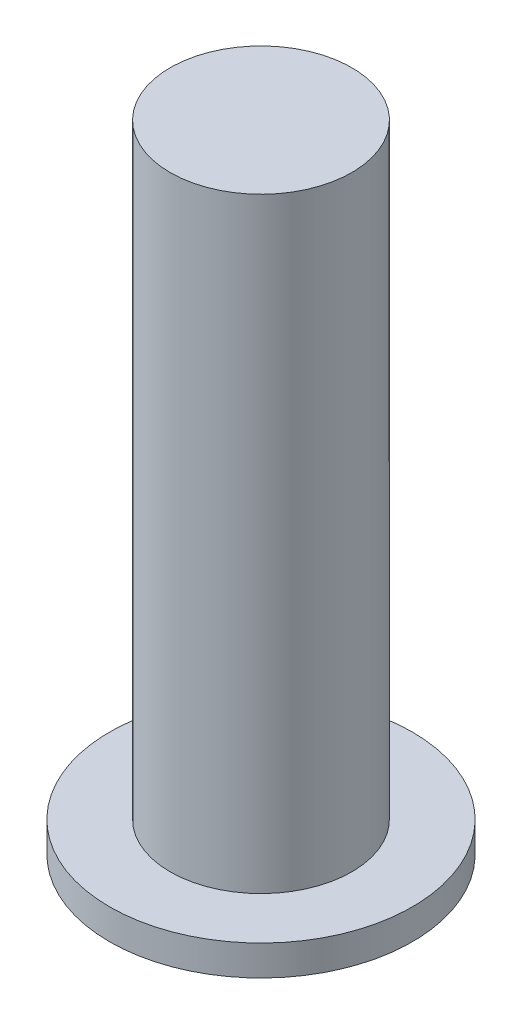
ISO-10303-21;
HEADER;
FILE_DESCRIPTION(('STEP AP214'),'2;1');
FILE_NAME('part.step','',(''),(''),'','','');
FILE_SCHEMA(('AUTOMOTIVE_DESIGN { 1 0 10303 214 1 1 1 1 }'));
ENDSEC;
DATA;
#1=APPLICATION_CONTEXT('core data for automotive mechanical design processes');
#2=APPLICATION_PROTOCOL_DEFINITION('international standard','automotive_design',2000,#1);
#3=PRODUCT_CONTEXT('',#1,'mechanical');
#4=PRODUCT('Part','Part','',(#3));
#5=PRODUCT_RELATED_PRODUCT_CATEGORY('part','',(#4));
#6=PRODUCT_DEFINITION_FORMATION('','',#4);
#7=PRODUCT_DEFINITION_CONTEXT('part definition',#1,'design');
#8=PRODUCT_DEFINITION('design','',#6,#7);
#9=PRODUCT_DEFINITION_SHAPE('','',#8);
#10=(LENGTH_UNIT() NAMED_UNIT(*) SI_UNIT(.MILLI.,.METRE.));
#11=(NAMED_UNIT(*) PLANE_ANGLE_UNIT() SI_UNIT($,.RADIAN.));
#12=(NAMED_UNIT(*) SI_UNIT($,.STERADIAN.) SOLID_ANGLE_UNIT());
#13=UNCERTAINTY_MEASURE_WITH_UNIT(LENGTH_MEASURE(1.E-05),#10,'distance_accuracy_value','');
#14=(GEOMETRIC_REPRESENTATION_CONTEXT(3) GLOBAL_UNCERTAINTY_ASSIGNED_CONTEXT((#13)) GLOBAL_UNIT_ASSIGNED_CONTEXT((#10,
#11,#12)) REPRESENTATION_CONTEXT('',''));
#15=CARTESIAN_POINT('',(0.,0.,0.));
#16=DIRECTION('',(0.,0.,1.));
#17=DIRECTION('',(1.,0.,0.));
#18=AXIS2_PLACEMENT_3D('',#15,#16,#17);
#19=CARTESIAN_POINT('',(0.,10.,0.));
#20=DIRECTION('',(0.,-1.,0.));
#21=DIRECTION('',(0.,0.,-1.));
#22=AXIS2_PLACEMENT_3D('',#19,#20,#21);
#23=CYLINDRICAL_SURFACE('',#22,50.);
#24=CARTESIAN_POINT('',(0.,10.,0.));
#25=DIRECTION('',(0.,1.,0.));
#26=DIRECTION('',(0.,0.,1.));
#27=AXIS2_PLACEMENT_3D('',#24,#25,#26);
#28=CIRCLE('',#27,50.);
#29=CARTESIAN_POINT('',(0.,10.,50.));
#30=VERTEX_POINT('',#29);
#31=EDGE_CURVE('E45',#30,#30,#28,.T.);
#32=ORIENTED_EDGE('',*,*,#31,.F.);
#33=EDGE_LOOP('',(#32));
#34=FACE_BOUND('',#33,.T.);
#35=CARTESIAN_POINT('',(0.,0.,0.));
#36=DIRECTION('',(0.,1.,0.));
#37=DIRECTION('',(0.,0.,1.));
#38=AXIS2_PLACEMENT_3D('',#35,#36,#37);
#39=CIRCLE('',#38,50.);
#40=CARTESIAN_POINT('',(0.,0.,50.));
#41=VERTEX_POINT('',#40);
#42=EDGE_CURVE('E40',#41,#41,#39,.T.);
#43=ORIENTED_EDGE('',*,*,#42,.T.);
#44=EDGE_LOOP('',(#43));
#45=FACE_BOUND('',#44,.T.);
#46=ADVANCED_FACE('F37',(#34,#45),#23,.T.);
#47=CARTESIAN_POINT('',(0.,10.,0.));
#48=DIRECTION('',(0.,1.,0.));
#49=DIRECTION('',(0.,0.,1.));
#50=AXIS2_PLACEMENT_3D('',#47,#48,#49);
#51=PLANE('',#50);
#52=CARTESIAN_POINT('',(0.,10.,0.));
#53=DIRECTION('',(0.,1.,0.));
#54=DIRECTION('',(0.,0.,1.));
#55=AXIS2_PLACEMENT_3D('',#52,#53,#54);
#56=CIRCLE('',#55,30.);
#57=CARTESIAN_POINT('',(0.,10.,30.));
#58=VERTEX_POINT('',#57);
#59=EDGE_CURVE('E10',#58,#58,#56,.T.);
#60=ORIENTED_EDGE('',*,*,#59,.F.);
#61=EDGE_LOOP('',(#60));
#62=FACE_BOUND('',#61,.T.);
#63=ORIENTED_EDGE('',*,*,#31,.T.);
#64=EDGE_LOOP('',(#63));
#65=FACE_BOUND('',#64,.T.);
#66=ADVANCED_FACE('F65',(#62,#65),#51,.T.);
#67=CARTESIAN_POINT('',(0.,0.,0.));
#68=DIRECTION('',(0.,1.,0.));
#69=DIRECTION('',(0.,0.,1.));
#70=AXIS2_PLACEMENT_3D('',#67,#68,#69);
#71=PLANE('',#70);
#72=ORIENTED_EDGE('',*,*,#42,.F.);
#73=EDGE_LOOP('',(#72));
#74=FACE_BOUND('',#73,.T.);
#75=ADVANCED_FACE('F62',(#74),#71,.F.);
#76=CARTESIAN_POINT('',(0.,210.,0.));
#77=DIRECTION('',(0.,-1.,0.));
#78=DIRECTION('',(0.,0.,-1.));
#79=AXIS2_PLACEMENT_3D('',#76,#77,#78);
#80=CYLINDRICAL_SURFACE('',#79,30.);
#81=CARTESIAN_POINT('',(0.,210.,0.));
#82=DIRECTION('',(0.,1.,0.));
#83=DIRECTION('',(0.,0.,1.));
#84=AXIS2_PLACEMENT_3D('',#81,#82,#83);
#85=CIRCLE('',#84,30.);
#86=CARTESIAN_POINT('',(0.,210.,30.));
#87=VERTEX_POINT('',#86);
#88=EDGE_CURVE('E52',#87,#87,#85,.T.);
#89=ORIENTED_EDGE('',*,*,#88,.F.);
#90=EDGE_LOOP('',(#89));
#91=FACE_BOUND('',#90,.T.);
#92=ORIENTED_EDGE('',*,*,#59,.T.);
#93=EDGE_LOOP('',(#92));
#94=FACE_BOUND('',#93,.T.);
#95=ADVANCED_FACE('F64',(#91,#94),#80,.T.);
#96=CARTESIAN_POINT('',(0.,210.,0.));
#97=DIRECTION('',(0.,1.,0.));
#98=DIRECTION('',(0.,0.,1.));
#99=AXIS2_PLACEMENT_3D('',#96,#97,#98);
#100=PLANE('',#99);
#101=ORIENTED_EDGE('',*,*,#88,.T.);
#102=EDGE_LOOP('',(#101));
#103=FACE_BOUND('',#102,.T.);
#104=ADVANCED_FACE('F70',(#103),#100,.T.);
#105=CLOSED_SHELL('',(#46,#66,#75,#95,#104));
#106=MANIFOLD_SOLID_BREP('B2',#105);
#107=ADVANCED_BREP_SHAPE_REPRESENTATION('',(#18,#106),#14);
#108=SHAPE_DEFINITION_REPRESENTATION(#9,#107);
ENDSEC;
END-ISO-10303-21;
